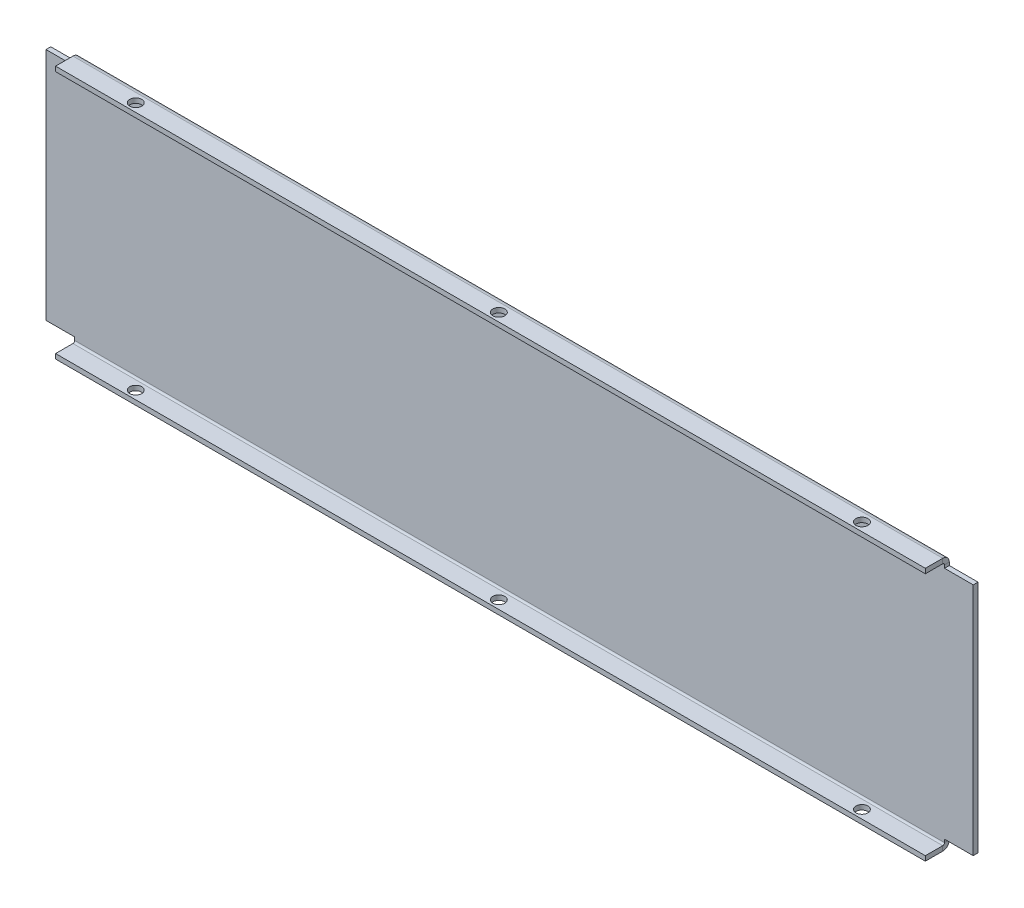
ISO-10303-21;
HEADER;
FILE_DESCRIPTION(('STEP AP214'),'2;1');
FILE_NAME('part.step','',(''),(''),'','','');
FILE_SCHEMA(('AUTOMOTIVE_DESIGN { 1 0 10303 214 1 1 1 1 }'));
ENDSEC;
DATA;
#1=APPLICATION_CONTEXT('core data for automotive mechanical design processes');
#2=APPLICATION_PROTOCOL_DEFINITION('international standard','automotive_design',2000,#1);
#3=PRODUCT_CONTEXT('',#1,'mechanical');
#4=PRODUCT('Part','Part','',(#3));
#5=PRODUCT_RELATED_PRODUCT_CATEGORY('part','',(#4));
#6=PRODUCT_DEFINITION_FORMATION('','',#4);
#7=PRODUCT_DEFINITION_CONTEXT('part definition',#1,'design');
#8=PRODUCT_DEFINITION('design','',#6,#7);
#9=PRODUCT_DEFINITION_SHAPE('','',#8);
#10=(LENGTH_UNIT() NAMED_UNIT(*) SI_UNIT(.MILLI.,.METRE.));
#11=(NAMED_UNIT(*) PLANE_ANGLE_UNIT() SI_UNIT($,.RADIAN.));
#12=(NAMED_UNIT(*) SI_UNIT($,.STERADIAN.) SOLID_ANGLE_UNIT());
#13=UNCERTAINTY_MEASURE_WITH_UNIT(LENGTH_MEASURE(1.E-05),#10,'distance_accuracy_value','');
#14=(GEOMETRIC_REPRESENTATION_CONTEXT(3) GLOBAL_UNCERTAINTY_ASSIGNED_CONTEXT((#13)) GLOBAL_UNIT_ASSIGNED_CONTEXT((#10,
#11,#12)) REPRESENTATION_CONTEXT('',''));
#15=CARTESIAN_POINT('',(0.,0.,0.));
#16=DIRECTION('',(0.,0.,1.));
#17=DIRECTION('',(1.,0.,0.));
#18=AXIS2_PLACEMENT_3D('',#15,#16,#17);
#19=CARTESIAN_POINT('',(181.7,-48.9999999999999,-24.4057905221938));
#20=DIRECTION('',(-1.,0.,0.));
#21=DIRECTION('',(0.,0.,1.));
#22=AXIS2_PLACEMENT_3D('',#19,#20,#21);
#23=PLANE('',#22);
#24=DIRECTION('',(0.,0.,-1.));
#25=VECTOR('',#24,1.);
#26=CARTESIAN_POINT('',(181.7,-52.9999999999999,-24.4057905221938));
#27=LINE('',#26,#25);
#28=CARTESIAN_POINT('',(181.7,-53.,7.99999999999999));
#29=VERTEX_POINT('',#28);
#30=CARTESIAN_POINT('',(181.7,-53.,0.736599999999962));
#31=VERTEX_POINT('',#30);
#32=EDGE_CURVE('E221',#29,#31,#27,.T.);
#33=ORIENTED_EDGE('',*,*,#32,.T.);
#34=DIRECTION('',(0.,1.,0.));
#35=VECTOR('',#34,1.);
#36=CARTESIAN_POINT('',(181.7,-53.,0.736599999999962));
#37=LINE('',#36,#35);
#38=CARTESIAN_POINT('',(181.7,-51.,0.736599999999976));
#39=VERTEX_POINT('',#38);
#40=EDGE_CURVE('E13',#31,#39,#37,.T.);
#41=ORIENTED_EDGE('',*,*,#40,.T.);
#42=DIRECTION('',(0.,0.,1.));
#43=VECTOR('',#42,1.);
#44=CARTESIAN_POINT('',(181.7,-51.,-1.83880688453541E-13));
#45=LINE('',#44,#43);
#46=CARTESIAN_POINT('',(181.7,-51.,8.00000000000001));
#47=VERTEX_POINT('',#46);
#48=EDGE_CURVE('E99',#39,#47,#45,.T.);
#49=ORIENTED_EDGE('',*,*,#48,.T.);
#50=DIRECTION('',(0.,1.,0.));
#51=VECTOR('',#50,1.);
#52=CARTESIAN_POINT('',(181.7,-53.,8.));
#53=LINE('',#52,#51);
#54=EDGE_CURVE('E219',#29,#47,#53,.T.);
#55=ORIENTED_EDGE('',*,*,#54,.F.);
#56=EDGE_LOOP('',(#33,#41,#49,#55));
#57=FACE_BOUND('',#56,.T.);
#58=ADVANCED_FACE('F82',(#57),#23,.F.);
#59=DIRECTION('',(0.,-1.,0.));
#60=VECTOR('',#59,1.);
#61=CARTESIAN_POINT('',(181.7,0.,0.));
#62=LINE('',#61,#60);
#63=CARTESIAN_POINT('',(181.7,-49.,0.));
#64=VERTEX_POINT('',#63);
#65=CARTESIAN_POINT('',(181.7,-50.2634,0.));
#66=VERTEX_POINT('',#65);
#67=EDGE_CURVE('E398',#64,#66,#62,.T.);
#68=ORIENTED_EDGE('',*,*,#67,.T.);
#69=DIRECTION('',(0.,0.,-1.));
#70=VECTOR('',#69,1.);
#71=CARTESIAN_POINT('',(181.7,-50.2634,0.));
#72=LINE('',#71,#70);
#73=CARTESIAN_POINT('',(181.7,-50.2634,-2.00000000000002));
#74=VERTEX_POINT('',#73);
#75=EDGE_CURVE('E92',#66,#74,#72,.T.);
#76=ORIENTED_EDGE('',*,*,#75,.T.);
#77=DIRECTION('',(0.,-1.,0.));
#78=VECTOR('',#77,1.);
#79=CARTESIAN_POINT('',(181.7,0.,-2.));
#80=LINE('',#79,#78);
#81=CARTESIAN_POINT('',(181.7,-49.,-2.00000000000001));
#82=VERTEX_POINT('',#81);
#83=EDGE_CURVE('E405',#82,#74,#80,.T.);
#84=ORIENTED_EDGE('',*,*,#83,.F.);
#85=DIRECTION('',(0.,0.,-1.));
#86=VECTOR('',#85,1.);
#87=CARTESIAN_POINT('',(181.7,-48.9999999999999,-24.4057905221938));
#88=LINE('',#87,#86);
#89=EDGE_CURVE('E238',#64,#82,#88,.T.);
#90=ORIENTED_EDGE('',*,*,#89,.F.);
#91=EDGE_LOOP('',(#68,#76,#84,#90));
#92=FACE_BOUND('',#91,.T.);
#93=ADVANCED_FACE('F556',(#92),#23,.F.);
#94=CARTESIAN_POINT('',(193.7,53.,-2.));
#95=DIRECTION('',(1.,0.,0.));
#96=DIRECTION('',(0.,0.,-1.));
#97=AXIS2_PLACEMENT_3D('',#94,#95,#96);
#98=PLANE('',#97);
#99=DIRECTION('',(0.,1.,0.));
#100=VECTOR('',#99,1.);
#101=CARTESIAN_POINT('',(193.7,53.,0.));
#102=LINE('',#101,#100);
#103=CARTESIAN_POINT('',(193.7,-49.,0.));
#104=VERTEX_POINT('',#103);
#105=CARTESIAN_POINT('',(193.7,49.,0.));
#106=VERTEX_POINT('',#105);
#107=EDGE_CURVE('E287',#104,#106,#102,.T.);
#108=ORIENTED_EDGE('',*,*,#107,.F.);
#109=DIRECTION('',(0.,0.,-1.));
#110=VECTOR('',#109,1.);
#111=CARTESIAN_POINT('',(193.7,-49.,-2.00000000000035));
#112=LINE('',#111,#110);
#113=CARTESIAN_POINT('',(193.7,-49.,-2.00000000000002));
#114=VERTEX_POINT('',#113);
#115=EDGE_CURVE('E227',#104,#114,#112,.T.);
#116=ORIENTED_EDGE('',*,*,#115,.T.);
#117=DIRECTION('',(0.,1.,0.));
#118=VECTOR('',#117,1.);
#119=CARTESIAN_POINT('',(193.7,53.,-2.));
#120=LINE('',#119,#118);
#121=CARTESIAN_POINT('',(193.7,49.,-2.00000000000002));
#122=VERTEX_POINT('',#121);
#123=EDGE_CURVE('E291',#114,#122,#120,.T.);
#124=ORIENTED_EDGE('',*,*,#123,.T.);
#125=DIRECTION('',(0.,0.,1.));
#126=VECTOR('',#125,1.);
#127=CARTESIAN_POINT('',(193.7,49.,-1.99999999999999));
#128=LINE('',#127,#126);
#129=EDGE_CURVE('E336',#122,#106,#128,.T.);
#130=ORIENTED_EDGE('',*,*,#129,.T.);
#131=EDGE_LOOP('',(#108,#116,#124,#130));
#132=FACE_BOUND('',#131,.T.);
#133=ADVANCED_FACE('F84',(#132),#98,.T.);
#134=CARTESIAN_POINT('',(181.7,48.9999999999999,-24.4057905221938));
#135=DIRECTION('',(1.,0.,0.));
#136=DIRECTION('',(0.,0.,-1.));
#137=AXIS2_PLACEMENT_3D('',#134,#135,#136);
#138=PLANE('',#137);
#139=DIRECTION('',(0.,0.,1.));
#140=VECTOR('',#139,1.);
#141=CARTESIAN_POINT('',(181.7,51.,-1.83880688453541E-13));
#142=LINE('',#141,#140);
#143=CARTESIAN_POINT('',(181.7,51.,0.73659999999999));
#144=VERTEX_POINT('',#143);
#145=CARTESIAN_POINT('',(181.7,51.,8.00000000000001));
#146=VERTEX_POINT('',#145);
#147=EDGE_CURVE('E420',#144,#146,#142,.T.);
#148=ORIENTED_EDGE('',*,*,#147,.F.);
#149=DIRECTION('',(0.,1.,0.));
#150=VECTOR('',#149,1.);
#151=CARTESIAN_POINT('',(181.7,51.,0.73659999999999));
#152=LINE('',#151,#150);
#153=CARTESIAN_POINT('',(181.7,53.,0.736599999999976));
#154=VERTEX_POINT('',#153);
#155=EDGE_CURVE('E228',#144,#154,#152,.T.);
#156=ORIENTED_EDGE('',*,*,#155,.T.);
#157=DIRECTION('',(0.,0.,-1.));
#158=VECTOR('',#157,1.);
#159=CARTESIAN_POINT('',(181.7,52.9999999999999,-24.4057905221938));
#160=LINE('',#159,#158);
#161=CARTESIAN_POINT('',(181.7,53.,8.));
#162=VERTEX_POINT('',#161);
#163=EDGE_CURVE('E107',#162,#154,#160,.T.);
#164=ORIENTED_EDGE('',*,*,#163,.F.);
#165=DIRECTION('',(0.,-1.,0.));
#166=VECTOR('',#165,1.);
#167=CARTESIAN_POINT('',(181.7,53.,8.));
#168=LINE('',#167,#166);
#169=EDGE_CURVE('E333',#162,#146,#168,.T.);
#170=ORIENTED_EDGE('',*,*,#169,.T.);
#171=EDGE_LOOP('',(#148,#156,#164,#170));
#172=FACE_BOUND('',#171,.T.);
#173=ADVANCED_FACE('F586',(#172),#138,.T.);
#174=DIRECTION('',(0.,1.,0.));
#175=VECTOR('',#174,1.);
#176=CARTESIAN_POINT('',(181.7,0.,-2.));
#177=LINE('',#176,#175);
#178=CARTESIAN_POINT('',(181.7,49.,-2.00000000000001));
#179=VERTEX_POINT('',#178);
#180=CARTESIAN_POINT('',(181.7,50.2634,-2.));
#181=VERTEX_POINT('',#180);
#182=EDGE_CURVE('E438',#179,#181,#177,.T.);
#183=ORIENTED_EDGE('',*,*,#182,.T.);
#184=DIRECTION('',(0.,0.,1.));
#185=VECTOR('',#184,1.);
#186=CARTESIAN_POINT('',(181.7,50.2634,-2.));
#187=LINE('',#186,#185);
#188=CARTESIAN_POINT('',(181.7,50.2634,0.));
#189=VERTEX_POINT('',#188);
#190=EDGE_CURVE('E340',#181,#189,#187,.T.);
#191=ORIENTED_EDGE('',*,*,#190,.T.);
#192=DIRECTION('',(0.,1.,0.));
#193=VECTOR('',#192,1.);
#194=CARTESIAN_POINT('',(181.7,0.,0.));
#195=LINE('',#194,#193);
#196=CARTESIAN_POINT('',(181.7,49.,0.));
#197=VERTEX_POINT('',#196);
#198=EDGE_CURVE('E430',#197,#189,#195,.T.);
#199=ORIENTED_EDGE('',*,*,#198,.F.);
#200=DIRECTION('',(0.,0.,-1.));
#201=VECTOR('',#200,1.);
#202=CARTESIAN_POINT('',(181.7,48.9999999999999,-24.4057905221938));
#203=LINE('',#202,#201);
#204=EDGE_CURVE('E416',#197,#179,#203,.T.);
#205=ORIENTED_EDGE('',*,*,#204,.T.);
#206=EDGE_LOOP('',(#183,#191,#199,#205));
#207=FACE_BOUND('',#206,.T.);
#208=ADVANCED_FACE('F570',(#207),#138,.T.);
#209=CARTESIAN_POINT('',(0.,0.,-2.));
#210=DIRECTION('',(0.,0.,1.));
#211=DIRECTION('',(1.,0.,0.));
#212=AXIS2_PLACEMENT_3D('',#209,#210,#211);
#213=PLANE('',#212);
#214=DIRECTION('',(1.,0.,0.));
#215=VECTOR('',#214,1.);
#216=CARTESIAN_POINT('',(0.,-49.,-2.));
#217=LINE('',#216,#215);
#218=EDGE_CURVE('E413',#82,#114,#217,.T.);
#219=ORIENTED_EDGE('',*,*,#218,.F.);
#220=ORIENTED_EDGE('',*,*,#83,.T.);
#221=DIRECTION('',(1.,0.,0.));
#222=VECTOR('',#221,1.);
#223=CARTESIAN_POINT('',(193.7,-50.2634,-2.00000000000002));
#224=LINE('',#223,#222);
#225=CARTESIAN_POINT('',(-181.7,-50.2634,-1.99999999999999));
#226=VERTEX_POINT('',#225);
#227=EDGE_CURVE('E251',#74,#226,#224,.F.);
#228=ORIENTED_EDGE('',*,*,#227,.T.);
#229=DIRECTION('',(0.,-1.,0.));
#230=VECTOR('',#229,1.);
#231=CARTESIAN_POINT('',(-181.7,0.,-2.));
#232=LINE('',#231,#230);
#233=CARTESIAN_POINT('',(-181.7,-49.,-2.00000000000001));
#234=VERTEX_POINT('',#233);
#235=EDGE_CURVE('E471',#234,#226,#232,.T.);
#236=ORIENTED_EDGE('',*,*,#235,.F.);
#237=DIRECTION('',(1.,0.,0.));
#238=VECTOR('',#237,1.);
#239=CARTESIAN_POINT('',(0.,-49.,-2.));
#240=LINE('',#239,#238);
#241=CARTESIAN_POINT('',(-193.7,-49.,-2.));
#242=VERTEX_POINT('',#241);
#243=EDGE_CURVE('E479',#242,#234,#240,.T.);
#244=ORIENTED_EDGE('',*,*,#243,.F.);
#245=DIRECTION('',(0.,-1.,0.));
#246=VECTOR('',#245,1.);
#247=CARTESIAN_POINT('',(-193.7,53.,-2.));
#248=LINE('',#247,#246);
#249=CARTESIAN_POINT('',(-193.7,49.,-2.));
#250=VERTEX_POINT('',#249);
#251=EDGE_CURVE('E294',#250,#242,#248,.T.);
#252=ORIENTED_EDGE('',*,*,#251,.F.);
#253=DIRECTION('',(-1.,0.,0.));
#254=VECTOR('',#253,1.);
#255=CARTESIAN_POINT('',(0.,49.,-2.));
#256=LINE('',#255,#254);
#257=CARTESIAN_POINT('',(-181.7,49.,-2.00000000000001));
#258=VERTEX_POINT('',#257);
#259=EDGE_CURVE('E256',#258,#250,#256,.T.);
#260=ORIENTED_EDGE('',*,*,#259,.F.);
#261=DIRECTION('',(0.,1.,0.));
#262=VECTOR('',#261,1.);
#263=CARTESIAN_POINT('',(-181.7,0.,-2.));
#264=LINE('',#263,#262);
#265=CARTESIAN_POINT('',(-181.7,50.2634,-1.99999999999998));
#266=VERTEX_POINT('',#265);
#267=EDGE_CURVE('E504',#258,#266,#264,.T.);
#268=ORIENTED_EDGE('',*,*,#267,.T.);
#269=DIRECTION('',(-1.,0.,0.));
#270=VECTOR('',#269,1.);
#271=CARTESIAN_POINT('',(-193.7,50.2634,-1.99999999999998));
#272=LINE('',#271,#270);
#273=EDGE_CURVE('E283',#266,#181,#272,.F.);
#274=ORIENTED_EDGE('',*,*,#273,.T.);
#275=ORIENTED_EDGE('',*,*,#182,.F.);
#276=DIRECTION('',(-1.,0.,0.));
#277=VECTOR('',#276,1.);
#278=CARTESIAN_POINT('',(0.,49.,-2.));
#279=LINE('',#278,#277);
#280=EDGE_CURVE('E446',#122,#179,#279,.T.);
#281=ORIENTED_EDGE('',*,*,#280,.F.);
#282=ORIENTED_EDGE('',*,*,#123,.F.);
#283=EDGE_LOOP('',(#219,#220,#228,#236,#244,#252,#260,#268,#274,#275,#281,#282));
#284=FACE_BOUND('',#283,.T.);
#285=ADVANCED_FACE('F524',(#284),#213,.F.);
#286=CARTESIAN_POINT('',(0.,0.,0.));
#287=DIRECTION('',(0.,0.,1.));
#288=DIRECTION('',(1.,0.,0.));
#289=AXIS2_PLACEMENT_3D('',#286,#287,#288);
#290=PLANE('',#289);
#291=ORIENTED_EDGE('',*,*,#67,.F.);
#292=DIRECTION('',(1.,0.,0.));
#293=VECTOR('',#292,1.);
#294=CARTESIAN_POINT('',(0.,-49.,0.));
#295=LINE('',#294,#293);
#296=EDGE_CURVE('E409',#64,#104,#295,.T.);
#297=ORIENTED_EDGE('',*,*,#296,.T.);
#298=ORIENTED_EDGE('',*,*,#107,.T.);
#299=DIRECTION('',(-1.,0.,0.));
#300=VECTOR('',#299,1.);
#301=CARTESIAN_POINT('',(0.,49.,0.));
#302=LINE('',#301,#300);
#303=EDGE_CURVE('E442',#106,#197,#302,.T.);
#304=ORIENTED_EDGE('',*,*,#303,.T.);
#305=ORIENTED_EDGE('',*,*,#198,.T.);
#306=DIRECTION('',(-1.,0.,0.));
#307=VECTOR('',#306,1.);
#308=CARTESIAN_POINT('',(-193.7,50.2634,0.));
#309=LINE('',#308,#307);
#310=CARTESIAN_POINT('',(-181.7,50.2634,0.));
#311=VERTEX_POINT('',#310);
#312=EDGE_CURVE('E272',#311,#189,#309,.F.);
#313=ORIENTED_EDGE('',*,*,#312,.F.);
#314=DIRECTION('',(0.,1.,0.));
#315=VECTOR('',#314,1.);
#316=CARTESIAN_POINT('',(-181.7,0.,0.));
#317=LINE('',#316,#315);
#318=CARTESIAN_POINT('',(-181.7,49.,0.));
#319=VERTEX_POINT('',#318);
#320=EDGE_CURVE('E496',#319,#311,#317,.T.);
#321=ORIENTED_EDGE('',*,*,#320,.F.);
#322=DIRECTION('',(-1.,0.,0.));
#323=VECTOR('',#322,1.);
#324=CARTESIAN_POINT('',(0.,49.,0.));
#325=LINE('',#324,#323);
#326=CARTESIAN_POINT('',(-193.7,49.,0.));
#327=VERTEX_POINT('',#326);
#328=EDGE_CURVE('E507',#319,#327,#325,.T.);
#329=ORIENTED_EDGE('',*,*,#328,.T.);
#330=DIRECTION('',(0.,-1.,0.));
#331=VECTOR('',#330,1.);
#332=CARTESIAN_POINT('',(-193.7,53.,0.));
#333=LINE('',#332,#331);
#334=CARTESIAN_POINT('',(-193.7,-49.,0.));
#335=VERTEX_POINT('',#334);
#336=EDGE_CURVE('E295',#327,#335,#333,.T.);
#337=ORIENTED_EDGE('',*,*,#336,.T.);
#338=DIRECTION('',(1.,0.,0.));
#339=VECTOR('',#338,1.);
#340=CARTESIAN_POINT('',(0.,-49.,0.));
#341=LINE('',#340,#339);
#342=CARTESIAN_POINT('',(-181.7,-49.,0.));
#343=VERTEX_POINT('',#342);
#344=EDGE_CURVE('E321',#335,#343,#341,.T.);
#345=ORIENTED_EDGE('',*,*,#344,.T.);
#346=DIRECTION('',(0.,-1.,0.));
#347=VECTOR('',#346,1.);
#348=CARTESIAN_POINT('',(-181.7,0.,0.));
#349=LINE('',#348,#347);
#350=CARTESIAN_POINT('',(-181.7,-50.2634,0.));
#351=VERTEX_POINT('',#350);
#352=EDGE_CURVE('E463',#343,#351,#349,.T.);
#353=ORIENTED_EDGE('',*,*,#352,.T.);
#354=DIRECTION('',(1.,0.,0.));
#355=VECTOR('',#354,1.);
#356=CARTESIAN_POINT('',(193.7,-50.2634,0.));
#357=LINE('',#356,#355);
#358=EDGE_CURVE('E246',#66,#351,#357,.F.);
#359=ORIENTED_EDGE('',*,*,#358,.F.);
#360=EDGE_LOOP('',(#291,#297,#298,#304,#305,#313,#321,#329,#337,#345,#353,#359));
#361=FACE_BOUND('',#360,.T.);
#362=ADVANCED_FACE('F534',(#361),#290,.T.);
#363=CARTESIAN_POINT('',(-193.7,50.2634,0.736600000000021));
#364=DIRECTION('',(-1.,0.,0.));
#365=DIRECTION('',(0.,1.,0.));
#366=AXIS2_PLACEMENT_3D('',#363,#364,#365);
#367=CYLINDRICAL_SURFACE('',#366,2.7366);
#368=DIRECTION('',(-1.,0.,0.));
#369=VECTOR('',#368,1.);
#370=CARTESIAN_POINT('',(193.7,53.,0.73659999999999));
#371=LINE('',#370,#369);
#372=CARTESIAN_POINT('',(-181.7,53.,0.736599999999983));
#373=VERTEX_POINT('',#372);
#374=EDGE_CURVE('E277',#373,#154,#371,.F.);
#375=ORIENTED_EDGE('',*,*,#374,.T.);
#376=CARTESIAN_POINT('',(181.7,50.2634,0.736599999999993));
#377=DIRECTION('',(1.,0.,0.));
#378=DIRECTION('',(0.,0.,-1.));
#379=AXIS2_PLACEMENT_3D('',#376,#377,#378);
#380=CIRCLE('',#379,2.7366);
#381=EDGE_CURVE('E434',#154,#181,#380,.F.);
#382=ORIENTED_EDGE('',*,*,#381,.T.);
#383=ORIENTED_EDGE('',*,*,#273,.F.);
#384=CARTESIAN_POINT('',(-181.7,50.2634,0.73660000000002));
#385=DIRECTION('',(1.,0.,0.));
#386=DIRECTION('',(0.,0.,-1.));
#387=AXIS2_PLACEMENT_3D('',#384,#385,#386);
#388=CIRCLE('',#387,2.7366);
#389=EDGE_CURVE('E500',#373,#266,#388,.F.);
#390=ORIENTED_EDGE('',*,*,#389,.F.);
#391=EDGE_LOOP('',(#375,#382,#383,#390));
#392=FACE_BOUND('',#391,.T.);
#393=ADVANCED_FACE('F573',(#392),#367,.T.);
#394=CARTESIAN_POINT('',(-193.7,50.2634,0.736600000000021));
#395=DIRECTION('',(-1.,0.,0.));
#396=DIRECTION('',(0.,1.,0.));
#397=AXIS2_PLACEMENT_3D('',#394,#395,#396);
#398=CYLINDRICAL_SURFACE('',#397,0.736599999999997);
#399=CARTESIAN_POINT('',(181.7,50.2634,0.736599999999993));
#400=DIRECTION('',(1.,0.,0.));
#401=DIRECTION('',(0.,0.,-1.));
#402=AXIS2_PLACEMENT_3D('',#399,#400,#401);
#403=CIRCLE('',#402,0.736599999999997);
#404=EDGE_CURVE('E426',#144,#189,#403,.F.);
#405=ORIENTED_EDGE('',*,*,#404,.F.);
#406=DIRECTION('',(-1.,0.,0.));
#407=VECTOR('',#406,1.);
#408=CARTESIAN_POINT('',(193.7,51.,0.736599999999997));
#409=LINE('',#408,#407);
#410=CARTESIAN_POINT('',(-181.7,51.,0.736599999999997));
#411=VERTEX_POINT('',#410);
#412=EDGE_CURVE('E266',#144,#411,#409,.T.);
#413=ORIENTED_EDGE('',*,*,#412,.T.);
#414=CARTESIAN_POINT('',(-181.7,50.2634,0.73660000000002));
#415=DIRECTION('',(1.,0.,0.));
#416=DIRECTION('',(0.,0.,-1.));
#417=AXIS2_PLACEMENT_3D('',#414,#415,#416);
#418=CIRCLE('',#417,0.736599999999997);
#419=EDGE_CURVE('E493',#411,#311,#418,.F.);
#420=ORIENTED_EDGE('',*,*,#419,.T.);
#421=ORIENTED_EDGE('',*,*,#312,.T.);
#422=EDGE_LOOP('',(#405,#413,#420,#421));
#423=FACE_BOUND('',#422,.T.);
#424=ADVANCED_FACE('F593',(#423),#398,.F.);
#425=CARTESIAN_POINT('',(0.,53.,-1.90863651131228E-13));
#426=DIRECTION('',(0.,-1.,0.));
#427=DIRECTION('',(0.,0.,-1.));
#428=AXIS2_PLACEMENT_3D('',#425,#426,#427);
#429=PLANE('',#428);
#430=CARTESIAN_POINT('',(151.699999999999,53.,4.50000000000126));
#431=DIRECTION('',(0.,-1.,0.));
#432=DIRECTION('',(0.,0.,-1.));
#433=AXIS2_PLACEMENT_3D('',#430,#431,#432);
#434=CIRCLE('',#433,2.5);
#435=CARTESIAN_POINT('',(151.699999999999,53.,2.00000000000127));
#436=VERTEX_POINT('',#435);
#437=EDGE_CURVE('E239',#436,#436,#434,.T.);
#438=ORIENTED_EDGE('',*,*,#437,.T.);
#439=EDGE_LOOP('',(#438));
#440=FACE_BOUND('',#439,.T.);
#441=CARTESIAN_POINT('',(-9.26498514846134E-13,53.,4.50000000000021));
#442=DIRECTION('',(0.,-1.,0.));
#443=DIRECTION('',(0.,0.,-1.));
#444=AXIS2_PLACEMENT_3D('',#441,#442,#443);
#445=CIRCLE('',#444,2.5);
#446=CARTESIAN_POINT('',(-9.26498514846134E-13,53.,2.00000000000021));
#447=VERTEX_POINT('',#446);
#448=EDGE_CURVE('E365',#447,#447,#445,.T.);
#449=ORIENTED_EDGE('',*,*,#448,.T.);
#450=EDGE_LOOP('',(#449));
#451=FACE_BOUND('',#450,.T.);
#452=CARTESIAN_POINT('',(-151.700000000001,53.,4.49999999999915));
#453=DIRECTION('',(0.,-1.,0.));
#454=DIRECTION('',(0.,0.,-1.));
#455=AXIS2_PLACEMENT_3D('',#452,#453,#454);
#456=CIRCLE('',#455,2.49999999999999);
#457=CARTESIAN_POINT('',(-151.700000000001,53.,1.99999999999916));
#458=VERTEX_POINT('',#457);
#459=EDGE_CURVE('E359',#458,#458,#456,.T.);
#460=ORIENTED_EDGE('',*,*,#459,.T.);
#461=EDGE_LOOP('',(#460));
#462=FACE_BOUND('',#461,.T.);
#463=ORIENTED_EDGE('',*,*,#163,.T.);
#464=ORIENTED_EDGE('',*,*,#374,.F.);
#465=DIRECTION('',(0.,0.,-1.));
#466=VECTOR('',#465,1.);
#467=CARTESIAN_POINT('',(-181.7,52.9999999999999,-24.4057905221938));
#468=LINE('',#467,#466);
#469=CARTESIAN_POINT('',(-181.7,53.,7.99999999999999));
#470=VERTEX_POINT('',#469);
#471=EDGE_CURVE('E482',#470,#373,#468,.T.);
#472=ORIENTED_EDGE('',*,*,#471,.F.);
#473=DIRECTION('',(1.,0.,0.));
#474=VECTOR('',#473,1.);
#475=CARTESIAN_POINT('',(0.,53.,8.));
#476=LINE('',#475,#474);
#477=EDGE_CURVE('E268',#470,#162,#476,.T.);
#478=ORIENTED_EDGE('',*,*,#477,.T.);
#479=EDGE_LOOP('',(#463,#464,#472,#478));
#480=FACE_BOUND('',#479,.T.);
#481=ADVANCED_FACE('F580',(#440,#451,#462,#480),#429,.F.);
#482=CARTESIAN_POINT('',(0.,51.,-1.83880688453541E-13));
#483=DIRECTION('',(0.,-1.,0.));
#484=DIRECTION('',(0.,0.,-1.));
#485=AXIS2_PLACEMENT_3D('',#482,#483,#484);
#486=PLANE('',#485);
#487=CARTESIAN_POINT('',(151.699999999999,51.,4.50000000000127));
#488=DIRECTION('',(0.,-1.,0.));
#489=DIRECTION('',(0.,0.,-1.));
#490=AXIS2_PLACEMENT_3D('',#487,#488,#489);
#491=CIRCLE('',#490,2.5);
#492=CARTESIAN_POINT('',(151.699999999999,51.,2.00000000000127));
#493=VERTEX_POINT('',#492);
#494=EDGE_CURVE('E382',#493,#493,#491,.T.);
#495=ORIENTED_EDGE('',*,*,#494,.F.);
#496=EDGE_LOOP('',(#495));
#497=FACE_BOUND('',#496,.T.);
#498=CARTESIAN_POINT('',(-9.26498514846134E-13,51.,4.50000000000022));
#499=DIRECTION('',(0.,-1.,0.));
#500=DIRECTION('',(0.,0.,-1.));
#501=AXIS2_PLACEMENT_3D('',#498,#499,#500);
#502=CIRCLE('',#501,2.5);
#503=CARTESIAN_POINT('',(-9.26498514846134E-13,51.,2.00000000000021));
#504=VERTEX_POINT('',#503);
#505=EDGE_CURVE('E358',#504,#504,#502,.T.);
#506=ORIENTED_EDGE('',*,*,#505,.F.);
#507=EDGE_LOOP('',(#506));
#508=FACE_BOUND('',#507,.T.);
#509=CARTESIAN_POINT('',(-151.700000000001,51.,4.49999999999916));
#510=DIRECTION('',(0.,-1.,0.));
#511=DIRECTION('',(0.,0.,-1.));
#512=AXIS2_PLACEMENT_3D('',#509,#510,#511);
#513=CIRCLE('',#512,2.49999999999999);
#514=CARTESIAN_POINT('',(-151.700000000001,51.,1.99999999999917));
#515=VERTEX_POINT('',#514);
#516=EDGE_CURVE('E353',#515,#515,#513,.T.);
#517=ORIENTED_EDGE('',*,*,#516,.F.);
#518=EDGE_LOOP('',(#517));
#519=FACE_BOUND('',#518,.T.);
#520=ORIENTED_EDGE('',*,*,#412,.F.);
#521=ORIENTED_EDGE('',*,*,#147,.T.);
#522=DIRECTION('',(-1.,0.,0.));
#523=VECTOR('',#522,1.);
#524=CARTESIAN_POINT('',(193.7,51.,8.00000000000001));
#525=LINE('',#524,#523);
#526=CARTESIAN_POINT('',(-181.7,51.,8.00000000000001));
#527=VERTEX_POINT('',#526);
#528=EDGE_CURVE('E273',#527,#146,#525,.F.);
#529=ORIENTED_EDGE('',*,*,#528,.F.);
#530=DIRECTION('',(0.,0.,1.));
#531=VECTOR('',#530,1.);
#532=CARTESIAN_POINT('',(-181.7,51.,-1.83880688453541E-13));
#533=LINE('',#532,#531);
#534=EDGE_CURVE('E487',#411,#527,#533,.T.);
#535=ORIENTED_EDGE('',*,*,#534,.F.);
#536=EDGE_LOOP('',(#520,#521,#529,#535));
#537=FACE_BOUND('',#536,.T.);
#538=ADVANCED_FACE('F590',(#497,#508,#519,#537),#486,.T.);
#539=CARTESIAN_POINT('',(193.7,53.,8.));
#540=DIRECTION('',(0.,0.,-1.));
#541=DIRECTION('',(0.,1.,0.));
#542=AXIS2_PLACEMENT_3D('',#539,#540,#541);
#543=PLANE('',#542);
#544=ORIENTED_EDGE('',*,*,#169,.F.);
#545=ORIENTED_EDGE('',*,*,#477,.F.);
#546=DIRECTION('',(0.,-1.,0.));
#547=VECTOR('',#546,1.);
#548=CARTESIAN_POINT('',(-181.7,53.,8.));
#549=LINE('',#548,#547);
#550=EDGE_CURVE('E299',#470,#527,#549,.T.);
#551=ORIENTED_EDGE('',*,*,#550,.T.);
#552=ORIENTED_EDGE('',*,*,#528,.T.);
#553=EDGE_LOOP('',(#544,#545,#551,#552));
#554=FACE_BOUND('',#553,.T.);
#555=ADVANCED_FACE('F584',(#554),#543,.F.);
#556=CARTESIAN_POINT('',(-181.7,-48.9999999999999,-24.4057905221938));
#557=DIRECTION('',(-1.,0.,0.));
#558=DIRECTION('',(0.,0.,1.));
#559=AXIS2_PLACEMENT_3D('',#556,#557,#558);
#560=PLANE('',#559);
#561=DIRECTION('',(0.,0.,1.));
#562=VECTOR('',#561,1.);
#563=CARTESIAN_POINT('',(-181.7,-51.,-1.83880688453541E-13));
#564=LINE('',#563,#562);
#565=CARTESIAN_POINT('',(-181.7,-51.,0.736599999999983));
#566=VERTEX_POINT('',#565);
#567=CARTESIAN_POINT('',(-181.7,-51.,8.00000000000001));
#568=VERTEX_POINT('',#567);
#569=EDGE_CURVE('E454',#566,#568,#564,.T.);
#570=ORIENTED_EDGE('',*,*,#569,.F.);
#571=DIRECTION('',(0.,-1.,0.));
#572=VECTOR('',#571,1.);
#573=CARTESIAN_POINT('',(-181.7,-51.,0.736599999999983));
#574=LINE('',#573,#572);
#575=CARTESIAN_POINT('',(-181.7,-53.,0.736599999999969));
#576=VERTEX_POINT('',#575);
#577=EDGE_CURVE('E329',#566,#576,#574,.T.);
#578=ORIENTED_EDGE('',*,*,#577,.T.);
#579=DIRECTION('',(0.,0.,-1.));
#580=VECTOR('',#579,1.);
#581=CARTESIAN_POINT('',(-181.7,-52.9999999999999,-24.4057905221938));
#582=LINE('',#581,#580);
#583=CARTESIAN_POINT('',(-181.7,-53.,8.));
#584=VERTEX_POINT('',#583);
#585=EDGE_CURVE('E449',#584,#576,#582,.T.);
#586=ORIENTED_EDGE('',*,*,#585,.F.);
#587=DIRECTION('',(0.,1.,0.));
#588=VECTOR('',#587,1.);
#589=CARTESIAN_POINT('',(-181.7,-53.,8.));
#590=LINE('',#589,#588);
#591=EDGE_CURVE('E244',#584,#568,#590,.T.);
#592=ORIENTED_EDGE('',*,*,#591,.T.);
#593=EDGE_LOOP('',(#570,#578,#586,#592));
#594=FACE_BOUND('',#593,.T.);
#595=ADVANCED_FACE('F546',(#594),#560,.T.);
#596=ORIENTED_EDGE('',*,*,#235,.T.);
#597=DIRECTION('',(0.,0.,1.));
#598=VECTOR('',#597,1.);
#599=CARTESIAN_POINT('',(-181.7,-50.2634,-1.99999999999999));
#600=LINE('',#599,#598);
#601=EDGE_CURVE('E325',#226,#351,#600,.T.);
#602=ORIENTED_EDGE('',*,*,#601,.T.);
#603=ORIENTED_EDGE('',*,*,#352,.F.);
#604=DIRECTION('',(0.,0.,-1.));
#605=VECTOR('',#604,1.);
#606=CARTESIAN_POINT('',(-181.7,-48.9999999999999,-24.4057905221938));
#607=LINE('',#606,#605);
#608=EDGE_CURVE('E450',#343,#234,#607,.T.);
#609=ORIENTED_EDGE('',*,*,#608,.T.);
#610=EDGE_LOOP('',(#596,#602,#603,#609));
#611=FACE_BOUND('',#610,.T.);
#612=ADVANCED_FACE('F530',(#611),#560,.T.);
#613=CARTESIAN_POINT('',(-193.7,53.,-2.));
#614=DIRECTION('',(-1.,0.,0.));
#615=DIRECTION('',(0.,0.,1.));
#616=AXIS2_PLACEMENT_3D('',#613,#614,#615);
#617=PLANE('',#616);
#618=ORIENTED_EDGE('',*,*,#251,.T.);
#619=DIRECTION('',(0.,0.,1.));
#620=VECTOR('',#619,1.);
#621=CARTESIAN_POINT('',(-193.7,-49.,-2.00000000000035));
#622=LINE('',#621,#620);
#623=EDGE_CURVE('E475',#242,#335,#622,.T.);
#624=ORIENTED_EDGE('',*,*,#623,.T.);
#625=ORIENTED_EDGE('',*,*,#336,.F.);
#626=DIRECTION('',(0.,0.,-1.));
#627=VECTOR('',#626,1.);
#628=CARTESIAN_POINT('',(-193.7,49.,-1.99999999999999));
#629=LINE('',#628,#627);
#630=EDGE_CURVE('E308',#327,#250,#629,.T.);
#631=ORIENTED_EDGE('',*,*,#630,.T.);
#632=EDGE_LOOP('',(#618,#624,#625,#631));
#633=FACE_BOUND('',#632,.T.);
#634=ADVANCED_FACE('F521',(#633),#617,.T.);
#635=CARTESIAN_POINT('',(193.7,-50.2634,0.736599999999978));
#636=DIRECTION('',(1.,0.,0.));
#637=DIRECTION('',(0.,-1.,0.));
#638=AXIS2_PLACEMENT_3D('',#635,#636,#637);
#639=CYLINDRICAL_SURFACE('',#638,2.7366);
#640=CARTESIAN_POINT('',(181.7,-50.2634,0.736599999999979));
#641=DIRECTION('',(-1.,0.,0.));
#642=DIRECTION('',(0.,0.,1.));
#643=AXIS2_PLACEMENT_3D('',#640,#641,#642);
#644=CIRCLE('',#643,2.7366);
#645=EDGE_CURVE('E401',#31,#74,#644,.F.);
#646=ORIENTED_EDGE('',*,*,#645,.F.);
#647=DIRECTION('',(1.,0.,0.));
#648=VECTOR('',#647,1.);
#649=CARTESIAN_POINT('',(-193.7,-53.,0.73659999999999));
#650=LINE('',#649,#648);
#651=EDGE_CURVE('E236',#31,#576,#650,.F.);
#652=ORIENTED_EDGE('',*,*,#651,.T.);
#653=CARTESIAN_POINT('',(-181.7,-50.2634,0.736600000000006));
#654=DIRECTION('',(-1.,0.,0.));
#655=DIRECTION('',(0.,0.,1.));
#656=AXIS2_PLACEMENT_3D('',#653,#654,#655);
#657=CIRCLE('',#656,2.7366);
#658=EDGE_CURVE('E467',#576,#226,#657,.F.);
#659=ORIENTED_EDGE('',*,*,#658,.T.);
#660=ORIENTED_EDGE('',*,*,#227,.F.);
#661=EDGE_LOOP('',(#646,#652,#659,#660));
#662=FACE_BOUND('',#661,.T.);
#663=ADVANCED_FACE('F552',(#662),#639,.T.);
#664=CARTESIAN_POINT('',(193.7,-50.2634,0.736599999999978));
#665=DIRECTION('',(1.,0.,0.));
#666=DIRECTION('',(0.,-1.,0.));
#667=AXIS2_PLACEMENT_3D('',#664,#665,#666);
#668=CYLINDRICAL_SURFACE('',#667,0.736599999999997);
#669=DIRECTION('',(1.,0.,0.));
#670=VECTOR('',#669,1.);
#671=CARTESIAN_POINT('',(-193.7,-51.,0.736599999999997));
#672=LINE('',#671,#670);
#673=EDGE_CURVE('E261',#566,#39,#672,.T.);
#674=ORIENTED_EDGE('',*,*,#673,.T.);
#675=CARTESIAN_POINT('',(181.7,-50.2634,0.736599999999979));
#676=DIRECTION('',(-1.,0.,0.));
#677=DIRECTION('',(0.,0.,1.));
#678=AXIS2_PLACEMENT_3D('',#675,#676,#677);
#679=CIRCLE('',#678,0.736599999999997);
#680=EDGE_CURVE('E394',#39,#66,#679,.F.);
#681=ORIENTED_EDGE('',*,*,#680,.T.);
#682=ORIENTED_EDGE('',*,*,#358,.T.);
#683=CARTESIAN_POINT('',(-181.7,-50.2634,0.736600000000006));
#684=DIRECTION('',(-1.,0.,0.));
#685=DIRECTION('',(0.,0.,1.));
#686=AXIS2_PLACEMENT_3D('',#683,#684,#685);
#687=CIRCLE('',#686,0.736599999999997);
#688=EDGE_CURVE('E460',#566,#351,#687,.F.);
#689=ORIENTED_EDGE('',*,*,#688,.F.);
#690=EDGE_LOOP('',(#674,#681,#682,#689));
#691=FACE_BOUND('',#690,.T.);
#692=ADVANCED_FACE('F537',(#691),#668,.F.);
#693=CARTESIAN_POINT('',(0.,-53.,-1.90863651131228E-13));
#694=DIRECTION('',(0.,1.,0.));
#695=DIRECTION('',(0.,0.,1.));
#696=AXIS2_PLACEMENT_3D('',#693,#694,#695);
#697=PLANE('',#696);
#698=CARTESIAN_POINT('',(151.699999999999,-53.,4.50000000000163));
#699=DIRECTION('',(0.,1.,0.));
#700=DIRECTION('',(0.,0.,1.));
#701=AXIS2_PLACEMENT_3D('',#698,#699,#700);
#702=CIRCLE('',#701,2.5);
#703=CARTESIAN_POINT('',(151.699999999999,-53.,7.00000000000163));
#704=VERTEX_POINT('',#703);
#705=EDGE_CURVE('E354',#704,#704,#702,.T.);
#706=ORIENTED_EDGE('',*,*,#705,.T.);
#707=EDGE_LOOP('',(#706));
#708=FACE_BOUND('',#707,.T.);
#709=CARTESIAN_POINT('',(-9.26498514846134E-13,-53.,4.50000000000058));
#710=DIRECTION('',(0.,1.,0.));
#711=DIRECTION('',(0.,0.,1.));
#712=AXIS2_PLACEMENT_3D('',#709,#710,#711);
#713=CIRCLE('',#712,2.5);
#714=CARTESIAN_POINT('',(-9.26498514846134E-13,-53.,7.00000000000058));
#715=VERTEX_POINT('',#714);
#716=EDGE_CURVE('E1014',#715,#715,#713,.T.);
#717=ORIENTED_EDGE('',*,*,#716,.T.);
#718=EDGE_LOOP('',(#717));
#719=FACE_BOUND('',#718,.T.);
#720=CARTESIAN_POINT('',(-151.700000000001,-53.,4.49999999999952));
#721=DIRECTION('',(0.,1.,0.));
#722=DIRECTION('',(0.,0.,1.));
#723=AXIS2_PLACEMENT_3D('',#720,#721,#722);
#724=CIRCLE('',#723,2.49999999999999);
#725=CARTESIAN_POINT('',(-151.700000000001,-53.,6.99999999999952));
#726=VERTEX_POINT('',#725);
#727=EDGE_CURVE('E1017',#726,#726,#724,.T.);
#728=ORIENTED_EDGE('',*,*,#727,.T.);
#729=EDGE_LOOP('',(#728));
#730=FACE_BOUND('',#729,.T.);
#731=ORIENTED_EDGE('',*,*,#651,.F.);
#732=ORIENTED_EDGE('',*,*,#32,.F.);
#733=DIRECTION('',(-1.,0.,0.));
#734=VECTOR('',#733,1.);
#735=CARTESIAN_POINT('',(0.,-53.,8.));
#736=LINE('',#735,#734);
#737=EDGE_CURVE('E234',#29,#584,#736,.T.);
#738=ORIENTED_EDGE('',*,*,#737,.T.);
#739=ORIENTED_EDGE('',*,*,#585,.T.);
#740=EDGE_LOOP('',(#731,#732,#738,#739));
#741=FACE_BOUND('',#740,.T.);
#742=ADVANCED_FACE('F232',(#708,#719,#730,#741),#697,.F.);
#743=CARTESIAN_POINT('',(0.,-51.,-1.83880688453541E-13));
#744=DIRECTION('',(0.,1.,0.));
#745=DIRECTION('',(0.,0.,1.));
#746=AXIS2_PLACEMENT_3D('',#743,#744,#745);
#747=PLANE('',#746);
#748=CARTESIAN_POINT('',(151.699999999999,-51.,4.50000000000162));
#749=DIRECTION('',(0.,1.,0.));
#750=DIRECTION('',(0.,0.,1.));
#751=AXIS2_PLACEMENT_3D('',#748,#749,#750);
#752=CIRCLE('',#751,2.5);
#753=CARTESIAN_POINT('',(151.699999999999,-51.,7.00000000000162));
#754=VERTEX_POINT('',#753);
#755=EDGE_CURVE('E86',#754,#754,#752,.T.);
#756=ORIENTED_EDGE('',*,*,#755,.F.);
#757=EDGE_LOOP('',(#756));
#758=FACE_BOUND('',#757,.T.);
#759=CARTESIAN_POINT('',(-9.26498514846134E-13,-51.,4.50000000000057));
#760=DIRECTION('',(0.,1.,0.));
#761=DIRECTION('',(0.,0.,1.));
#762=AXIS2_PLACEMENT_3D('',#759,#760,#761);
#763=CIRCLE('',#762,2.5);
#764=CARTESIAN_POINT('',(-9.26498514846134E-13,-51.,7.00000000000057));
#765=VERTEX_POINT('',#764);
#766=EDGE_CURVE('E355',#765,#765,#763,.T.);
#767=ORIENTED_EDGE('',*,*,#766,.F.);
#768=EDGE_LOOP('',(#767));
#769=FACE_BOUND('',#768,.T.);
#770=CARTESIAN_POINT('',(-151.700000000001,-51.,4.49999999999952));
#771=DIRECTION('',(0.,1.,0.));
#772=DIRECTION('',(0.,0.,1.));
#773=AXIS2_PLACEMENT_3D('',#770,#771,#772);
#774=CIRCLE('',#773,2.49999999999999);
#775=CARTESIAN_POINT('',(-151.700000000001,-51.,6.99999999999951));
#776=VERTEX_POINT('',#775);
#777=EDGE_CURVE('E350',#776,#776,#774,.T.);
#778=ORIENTED_EDGE('',*,*,#777,.F.);
#779=EDGE_LOOP('',(#778));
#780=FACE_BOUND('',#779,.T.);
#781=ORIENTED_EDGE('',*,*,#48,.F.);
#782=ORIENTED_EDGE('',*,*,#673,.F.);
#783=ORIENTED_EDGE('',*,*,#569,.T.);
#784=DIRECTION('',(1.,0.,0.));
#785=VECTOR('',#784,1.);
#786=CARTESIAN_POINT('',(-193.7,-51.,8.00000000000001));
#787=LINE('',#786,#785);
#788=EDGE_CURVE('E247',#47,#568,#787,.F.);
#789=ORIENTED_EDGE('',*,*,#788,.F.);
#790=EDGE_LOOP('',(#781,#782,#783,#789));
#791=FACE_BOUND('',#790,.T.);
#792=ADVANCED_FACE('F543',(#758,#769,#780,#791),#747,.T.);
#793=CARTESIAN_POINT('',(-193.7,-53.,8.));
#794=DIRECTION('',(0.,0.,-1.));
#795=DIRECTION('',(0.,1.,0.));
#796=AXIS2_PLACEMENT_3D('',#793,#794,#795);
#797=PLANE('',#796);
#798=ORIENTED_EDGE('',*,*,#737,.F.);
#799=ORIENTED_EDGE('',*,*,#54,.T.);
#800=ORIENTED_EDGE('',*,*,#788,.T.);
#801=ORIENTED_EDGE('',*,*,#591,.F.);
#802=EDGE_LOOP('',(#798,#799,#800,#801));
#803=FACE_BOUND('',#802,.T.);
#804=ADVANCED_FACE('F242',(#803),#797,.F.);
#805=CARTESIAN_POINT('',(-181.7,48.9999999999999,-24.4057905221938));
#806=DIRECTION('',(1.,0.,0.));
#807=DIRECTION('',(0.,0.,-1.));
#808=AXIS2_PLACEMENT_3D('',#805,#806,#807);
#809=PLANE('',#808);
#810=ORIENTED_EDGE('',*,*,#471,.T.);
#811=DIRECTION('',(0.,-1.,0.));
#812=VECTOR('',#811,1.);
#813=CARTESIAN_POINT('',(-181.7,53.,0.736599999999983));
#814=LINE('',#813,#812);
#815=EDGE_CURVE('E315',#373,#411,#814,.T.);
#816=ORIENTED_EDGE('',*,*,#815,.T.);
#817=ORIENTED_EDGE('',*,*,#534,.T.);
#818=ORIENTED_EDGE('',*,*,#550,.F.);
#819=EDGE_LOOP('',(#810,#816,#817,#818));
#820=FACE_BOUND('',#819,.T.);
#821=ADVANCED_FACE('F597',(#820),#809,.F.);
#822=ORIENTED_EDGE('',*,*,#320,.T.);
#823=DIRECTION('',(0.,0.,-1.));
#824=VECTOR('',#823,1.);
#825=CARTESIAN_POINT('',(-181.7,50.2634,0.));
#826=LINE('',#825,#824);
#827=EDGE_CURVE('E312',#311,#266,#826,.T.);
#828=ORIENTED_EDGE('',*,*,#827,.T.);
#829=ORIENTED_EDGE('',*,*,#267,.F.);
#830=DIRECTION('',(0.,0.,-1.));
#831=VECTOR('',#830,1.);
#832=CARTESIAN_POINT('',(-181.7,48.9999999999999,-24.4057905221938));
#833=LINE('',#832,#831);
#834=EDGE_CURVE('E483',#319,#258,#833,.T.);
#835=ORIENTED_EDGE('',*,*,#834,.F.);
#836=EDGE_LOOP('',(#822,#828,#829,#835));
#837=FACE_BOUND('',#836,.T.);
#838=ADVANCED_FACE('F601',(#837),#809,.F.);
#839=CARTESIAN_POINT('',(0.,49.,-1.69870806830424E-13));
#840=DIRECTION('',(0.,1.,0.));
#841=DIRECTION('',(0.,0.,1.));
#842=AXIS2_PLACEMENT_3D('',#839,#840,#841);
#843=PLANE('',#842);
#844=ORIENTED_EDGE('',*,*,#259,.T.);
#845=ORIENTED_EDGE('',*,*,#630,.F.);
#846=ORIENTED_EDGE('',*,*,#328,.F.);
#847=ORIENTED_EDGE('',*,*,#834,.T.);
#848=EDGE_LOOP('',(#844,#845,#846,#847));
#849=FACE_BOUND('',#848,.T.);
#850=ADVANCED_FACE('F516',(#849),#843,.T.);
#851=ORIENTED_EDGE('',*,*,#815,.F.);
#852=ORIENTED_EDGE('',*,*,#389,.T.);
#853=ORIENTED_EDGE('',*,*,#827,.F.);
#854=ORIENTED_EDGE('',*,*,#419,.F.);
#855=EDGE_LOOP('',(#851,#852,#853,#854));
#856=FACE_BOUND('',#855,.T.);
#857=ADVANCED_FACE('F599',(#856),#809,.F.);
#858=CARTESIAN_POINT('',(0.,-49.,-1.69870806830424E-13));
#859=DIRECTION('',(0.,-1.,0.));
#860=DIRECTION('',(0.,0.,1.));
#861=AXIS2_PLACEMENT_3D('',#858,#859,#860);
#862=PLANE('',#861);
#863=ORIENTED_EDGE('',*,*,#243,.T.);
#864=ORIENTED_EDGE('',*,*,#608,.F.);
#865=ORIENTED_EDGE('',*,*,#344,.F.);
#866=ORIENTED_EDGE('',*,*,#623,.F.);
#867=EDGE_LOOP('',(#863,#864,#865,#866));
#868=FACE_BOUND('',#867,.T.);
#869=ADVANCED_FACE('F528',(#868),#862,.T.);
#870=ORIENTED_EDGE('',*,*,#577,.F.);
#871=ORIENTED_EDGE('',*,*,#688,.T.);
#872=ORIENTED_EDGE('',*,*,#601,.F.);
#873=ORIENTED_EDGE('',*,*,#658,.F.);
#874=EDGE_LOOP('',(#870,#871,#872,#873));
#875=FACE_BOUND('',#874,.T.);
#876=ADVANCED_FACE('F549',(#875),#560,.T.);
#877=CARTESIAN_POINT('',(0.,49.,-1.69870806830424E-13));
#878=DIRECTION('',(0.,1.,0.));
#879=DIRECTION('',(0.,0.,1.));
#880=AXIS2_PLACEMENT_3D('',#877,#878,#879);
#881=PLANE('',#880);
#882=ORIENTED_EDGE('',*,*,#280,.T.);
#883=ORIENTED_EDGE('',*,*,#204,.F.);
#884=ORIENTED_EDGE('',*,*,#303,.F.);
#885=ORIENTED_EDGE('',*,*,#129,.F.);
#886=EDGE_LOOP('',(#882,#883,#884,#885));
#887=FACE_BOUND('',#886,.T.);
#888=ADVANCED_FACE('F565',(#887),#881,.T.);
#889=ORIENTED_EDGE('',*,*,#155,.F.);
#890=ORIENTED_EDGE('',*,*,#404,.T.);
#891=ORIENTED_EDGE('',*,*,#190,.F.);
#892=ORIENTED_EDGE('',*,*,#381,.F.);
#893=EDGE_LOOP('',(#889,#890,#891,#892));
#894=FACE_BOUND('',#893,.T.);
#895=ADVANCED_FACE('F577',(#894),#138,.T.);
#896=CARTESIAN_POINT('',(0.,-49.,-1.69870806830424E-13));
#897=DIRECTION('',(0.,-1.,0.));
#898=DIRECTION('',(0.,0.,1.));
#899=AXIS2_PLACEMENT_3D('',#896,#897,#898);
#900=PLANE('',#899);
#901=ORIENTED_EDGE('',*,*,#218,.T.);
#902=ORIENTED_EDGE('',*,*,#115,.F.);
#903=ORIENTED_EDGE('',*,*,#296,.F.);
#904=ORIENTED_EDGE('',*,*,#89,.T.);
#905=EDGE_LOOP('',(#901,#902,#903,#904));
#906=FACE_BOUND('',#905,.T.);
#907=ADVANCED_FACE('F558',(#906),#900,.T.);
#908=ORIENTED_EDGE('',*,*,#40,.F.);
#909=ORIENTED_EDGE('',*,*,#645,.T.);
#910=ORIENTED_EDGE('',*,*,#75,.F.);
#911=ORIENTED_EDGE('',*,*,#680,.F.);
#912=EDGE_LOOP('',(#908,#909,#910,#911));
#913=FACE_BOUND('',#912,.T.);
#914=ADVANCED_FACE('F541',(#913),#23,.F.);
#915=CARTESIAN_POINT('',(-151.700000000001,-53.,4.49999999999952));
#916=DIRECTION('',(0.,1.,0.));
#917=DIRECTION('',(0.,0.,1.));
#918=AXIS2_PLACEMENT_3D('',#915,#916,#917);
#919=CYLINDRICAL_SURFACE('',#918,2.49999999999999);
#920=ORIENTED_EDGE('',*,*,#777,.T.);
#921=EDGE_LOOP('',(#920));
#922=FACE_BOUND('',#921,.T.);
#923=ORIENTED_EDGE('',*,*,#727,.F.);
#924=EDGE_LOOP('',(#923));
#925=FACE_BOUND('',#924,.T.);
#926=ADVANCED_FACE('F619',(#922,#925),#919,.F.);
#927=CARTESIAN_POINT('',(-9.26498514846134E-13,-53.,4.50000000000058));
#928=DIRECTION('',(0.,1.,0.));
#929=DIRECTION('',(0.,0.,1.));
#930=AXIS2_PLACEMENT_3D('',#927,#928,#929);
#931=CYLINDRICAL_SURFACE('',#930,2.5);
#932=ORIENTED_EDGE('',*,*,#766,.T.);
#933=EDGE_LOOP('',(#932));
#934=FACE_BOUND('',#933,.T.);
#935=ORIENTED_EDGE('',*,*,#716,.F.);
#936=EDGE_LOOP('',(#935));
#937=FACE_BOUND('',#936,.T.);
#938=ADVANCED_FACE('F624',(#934,#937),#931,.F.);
#939=CARTESIAN_POINT('',(151.699999999999,-53.,4.50000000000163));
#940=DIRECTION('',(0.,1.,0.));
#941=DIRECTION('',(0.,0.,1.));
#942=AXIS2_PLACEMENT_3D('',#939,#940,#941);
#943=CYLINDRICAL_SURFACE('',#942,2.5);
#944=ORIENTED_EDGE('',*,*,#755,.T.);
#945=EDGE_LOOP('',(#944));
#946=FACE_BOUND('',#945,.T.);
#947=ORIENTED_EDGE('',*,*,#705,.F.);
#948=EDGE_LOOP('',(#947));
#949=FACE_BOUND('',#948,.T.);
#950=ADVANCED_FACE('F635',(#946,#949),#943,.F.);
#951=ORIENTED_EDGE('',*,*,#516,.T.);
#952=EDGE_LOOP('',(#951));
#953=FACE_BOUND('',#952,.T.);
#954=ORIENTED_EDGE('',*,*,#459,.F.);
#955=EDGE_LOOP('',(#954));
#956=FACE_BOUND('',#955,.T.);
#957=ADVANCED_FACE('F627',(#953,#956),#919,.F.);
#958=ORIENTED_EDGE('',*,*,#505,.T.);
#959=EDGE_LOOP('',(#958));
#960=FACE_BOUND('',#959,.T.);
#961=ORIENTED_EDGE('',*,*,#448,.F.);
#962=EDGE_LOOP('',(#961));
#963=FACE_BOUND('',#962,.T.);
#964=ADVANCED_FACE('F636',(#960,#963),#931,.F.);
#965=ORIENTED_EDGE('',*,*,#494,.T.);
#966=EDGE_LOOP('',(#965));
#967=FACE_BOUND('',#966,.T.);
#968=ORIENTED_EDGE('',*,*,#437,.F.);
#969=EDGE_LOOP('',(#968));
#970=FACE_BOUND('',#969,.T.);
#971=ADVANCED_FACE('F639',(#967,#970),#943,.F.);
#972=CLOSED_SHELL('',(#58,#93,#133,#173,#208,#285,#362,#393,#424,#481,#538,#555,#595,#612,#634,
#663,#692,#742,#792,#804,#821,#838,#850,#857,#869,#876,#888,#895,#907,#914,#926,#938,#950,#957,
#964,#971));
#973=MANIFOLD_SOLID_BREP('B2',#972);
#974=ADVANCED_BREP_SHAPE_REPRESENTATION('',(#18,#973),#14);
#975=SHAPE_DEFINITION_REPRESENTATION(#9,#974);
ENDSEC;
END-ISO-10303-21;
